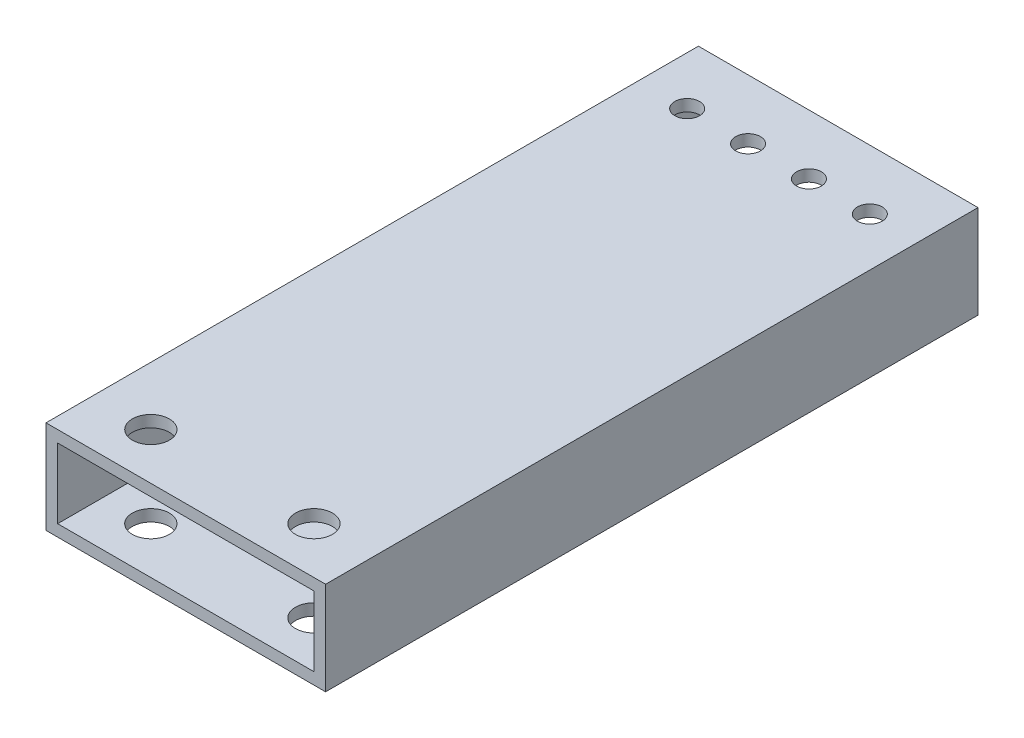
ISO-10303-21;
HEADER;
FILE_DESCRIPTION(('STEP AP214'),'2;1');
FILE_NAME('part.step','',(''),(''),'','','');
FILE_SCHEMA(('AUTOMOTIVE_DESIGN { 1 0 10303 214 1 1 1 1 }'));
ENDSEC;
DATA;
#1=APPLICATION_CONTEXT('core data for automotive mechanical design processes');
#2=APPLICATION_PROTOCOL_DEFINITION('international standard','automotive_design',2000,#1);
#3=PRODUCT_CONTEXT('',#1,'mechanical');
#4=PRODUCT('Part','Part','',(#3));
#5=PRODUCT_RELATED_PRODUCT_CATEGORY('part','',(#4));
#6=PRODUCT_DEFINITION_FORMATION('','',#4);
#7=PRODUCT_DEFINITION_CONTEXT('part definition',#1,'design');
#8=PRODUCT_DEFINITION('design','',#6,#7);
#9=PRODUCT_DEFINITION_SHAPE('','',#8);
#10=(LENGTH_UNIT() NAMED_UNIT(*) SI_UNIT(.MILLI.,.METRE.));
#11=(NAMED_UNIT(*) PLANE_ANGLE_UNIT() SI_UNIT($,.RADIAN.));
#12=(NAMED_UNIT(*) SI_UNIT($,.STERADIAN.) SOLID_ANGLE_UNIT());
#13=UNCERTAINTY_MEASURE_WITH_UNIT(LENGTH_MEASURE(1.E-05),#10,'distance_accuracy_value','');
#14=(GEOMETRIC_REPRESENTATION_CONTEXT(3) GLOBAL_UNCERTAINTY_ASSIGNED_CONTEXT((#13)) GLOBAL_UNIT_ASSIGNED_CONTEXT((#10,
#11,#12)) REPRESENTATION_CONTEXT('',''));
#15=CARTESIAN_POINT('',(0.,0.,0.));
#16=DIRECTION('',(0.,0.,1.));
#17=DIRECTION('',(1.,0.,0.));
#18=AXIS2_PLACEMENT_3D('',#15,#16,#17);
#19=CARTESIAN_POINT('',(0.,0.,177.8));
#20=DIRECTION('',(0.,0.,-1.));
#21=DIRECTION('',(-1.,0.,0.));
#22=AXIS2_PLACEMENT_3D('',#19,#20,#21);
#23=PLANE('',#22);
#24=DIRECTION('',(0.,-1.,0.));
#25=VECTOR('',#24,1.);
#26=CARTESIAN_POINT('',(0.,0.,177.8));
#27=LINE('',#26,#25);
#28=CARTESIAN_POINT('',(0.,25.4,177.8));
#29=VERTEX_POINT('',#28);
#30=CARTESIAN_POINT('',(0.,0.,177.8));
#31=VERTEX_POINT('',#30);
#32=EDGE_CURVE('E139',#29,#31,#27,.T.);
#33=ORIENTED_EDGE('',*,*,#32,.T.);
#34=DIRECTION('',(1.,0.,0.));
#35=VECTOR('',#34,1.);
#36=CARTESIAN_POINT('',(0.,0.,177.8));
#37=LINE('',#36,#35);
#38=CARTESIAN_POINT('',(76.2,0.,177.8));
#39=VERTEX_POINT('',#38);
#40=EDGE_CURVE('E142',#31,#39,#37,.T.);
#41=ORIENTED_EDGE('',*,*,#40,.T.);
#42=DIRECTION('',(0.,1.,0.));
#43=VECTOR('',#42,1.);
#44=CARTESIAN_POINT('',(76.2,0.,177.8));
#45=LINE('',#44,#43);
#46=CARTESIAN_POINT('',(76.2,25.4,177.8));
#47=VERTEX_POINT('',#46);
#48=EDGE_CURVE('E145',#39,#47,#45,.T.);
#49=ORIENTED_EDGE('',*,*,#48,.T.);
#50=DIRECTION('',(-1.,0.,0.));
#51=VECTOR('',#50,1.);
#52=CARTESIAN_POINT('',(0.,25.4,177.8));
#53=LINE('',#52,#51);
#54=EDGE_CURVE('E147',#47,#29,#53,.T.);
#55=ORIENTED_EDGE('',*,*,#54,.T.);
#56=EDGE_LOOP('',(#33,#41,#49,#55));
#57=FACE_BOUND('',#56,.T.);
#58=DIRECTION('',(0.,-1.,0.));
#59=VECTOR('',#58,1.);
#60=CARTESIAN_POINT('',(3.175,3.175,177.8));
#61=LINE('',#60,#59);
#62=CARTESIAN_POINT('',(3.175,22.225,177.8));
#63=VERTEX_POINT('',#62);
#64=CARTESIAN_POINT('',(3.175,3.175,177.8));
#65=VERTEX_POINT('',#64);
#66=EDGE_CURVE('E101',#63,#65,#61,.T.);
#67=ORIENTED_EDGE('',*,*,#66,.F.);
#68=DIRECTION('',(-1.,0.,0.));
#69=VECTOR('',#68,1.);
#70=CARTESIAN_POINT('',(3.175,22.225,177.8));
#71=LINE('',#70,#69);
#72=CARTESIAN_POINT('',(73.025,22.225,177.8));
#73=VERTEX_POINT('',#72);
#74=EDGE_CURVE('E123',#73,#63,#71,.T.);
#75=ORIENTED_EDGE('',*,*,#74,.F.);
#76=DIRECTION('',(0.,1.,0.));
#77=VECTOR('',#76,1.);
#78=CARTESIAN_POINT('',(73.025,3.175,177.8));
#79=LINE('',#78,#77);
#80=CARTESIAN_POINT('',(73.025,3.175,177.8));
#81=VERTEX_POINT('',#80);
#82=EDGE_CURVE('E121',#81,#73,#79,.T.);
#83=ORIENTED_EDGE('',*,*,#82,.F.);
#84=DIRECTION('',(1.,0.,0.));
#85=VECTOR('',#84,1.);
#86=CARTESIAN_POINT('',(3.175,3.175,177.8));
#87=LINE('',#86,#85);
#88=EDGE_CURVE('E109',#65,#81,#87,.T.);
#89=ORIENTED_EDGE('',*,*,#88,.F.);
#90=EDGE_LOOP('',(#67,#75,#83,#89));
#91=FACE_BOUND('',#90,.T.);
#92=ADVANCED_FACE('F34',(#57,#91),#23,.F.);
#93=CARTESIAN_POINT('',(0.,0.,0.));
#94=DIRECTION('',(0.,0.,-1.));
#95=DIRECTION('',(-1.,0.,0.));
#96=AXIS2_PLACEMENT_3D('',#93,#94,#95);
#97=PLANE('',#96);
#98=DIRECTION('',(0.,-1.,0.));
#99=VECTOR('',#98,1.);
#100=CARTESIAN_POINT('',(0.,0.,0.));
#101=LINE('',#100,#99);
#102=CARTESIAN_POINT('',(0.,25.4,0.));
#103=VERTEX_POINT('',#102);
#104=CARTESIAN_POINT('',(0.,0.,0.));
#105=VERTEX_POINT('',#104);
#106=EDGE_CURVE('E117',#103,#105,#101,.T.);
#107=ORIENTED_EDGE('',*,*,#106,.F.);
#108=DIRECTION('',(-1.,0.,0.));
#109=VECTOR('',#108,1.);
#110=CARTESIAN_POINT('',(0.,25.4,0.));
#111=LINE('',#110,#109);
#112=CARTESIAN_POINT('',(76.2,25.4,0.));
#113=VERTEX_POINT('',#112);
#114=EDGE_CURVE('E143',#113,#103,#111,.T.);
#115=ORIENTED_EDGE('',*,*,#114,.F.);
#116=DIRECTION('',(0.,1.,0.));
#117=VECTOR('',#116,1.);
#118=CARTESIAN_POINT('',(76.2,0.,0.));
#119=LINE('',#118,#117);
#120=CARTESIAN_POINT('',(76.2,0.,0.));
#121=VERTEX_POINT('',#120);
#122=EDGE_CURVE('E154',#121,#113,#119,.T.);
#123=ORIENTED_EDGE('',*,*,#122,.F.);
#124=DIRECTION('',(1.,0.,0.));
#125=VECTOR('',#124,1.);
#126=CARTESIAN_POINT('',(0.,0.,0.));
#127=LINE('',#126,#125);
#128=EDGE_CURVE('E152',#105,#121,#127,.T.);
#129=ORIENTED_EDGE('',*,*,#128,.F.);
#130=EDGE_LOOP('',(#107,#115,#123,#129));
#131=FACE_BOUND('',#130,.T.);
#132=DIRECTION('',(-1.,0.,0.));
#133=VECTOR('',#132,1.);
#134=CARTESIAN_POINT('',(3.175,22.225,0.));
#135=LINE('',#134,#133);
#136=CARTESIAN_POINT('',(73.025,22.225,0.));
#137=VERTEX_POINT('',#136);
#138=CARTESIAN_POINT('',(3.175,22.225,0.));
#139=VERTEX_POINT('',#138);
#140=EDGE_CURVE('E110',#137,#139,#135,.T.);
#141=ORIENTED_EDGE('',*,*,#140,.T.);
#142=DIRECTION('',(0.,-1.,0.));
#143=VECTOR('',#142,1.);
#144=CARTESIAN_POINT('',(3.175,3.175,0.));
#145=LINE('',#144,#143);
#146=CARTESIAN_POINT('',(3.175,3.175,0.));
#147=VERTEX_POINT('',#146);
#148=EDGE_CURVE('E59',#139,#147,#145,.T.);
#149=ORIENTED_EDGE('',*,*,#148,.T.);
#150=DIRECTION('',(1.,0.,0.));
#151=VECTOR('',#150,1.);
#152=CARTESIAN_POINT('',(3.175,3.175,0.));
#153=LINE('',#152,#151);
#154=CARTESIAN_POINT('',(73.025,3.175,0.));
#155=VERTEX_POINT('',#154);
#156=EDGE_CURVE('E116',#147,#155,#153,.T.);
#157=ORIENTED_EDGE('',*,*,#156,.T.);
#158=DIRECTION('',(0.,1.,0.));
#159=VECTOR('',#158,1.);
#160=CARTESIAN_POINT('',(73.025,3.175,0.));
#161=LINE('',#160,#159);
#162=EDGE_CURVE('E131',#155,#137,#161,.T.);
#163=ORIENTED_EDGE('',*,*,#162,.T.);
#164=EDGE_LOOP('',(#141,#149,#157,#163));
#165=FACE_BOUND('',#164,.T.);
#166=ADVANCED_FACE('F248',(#131,#165),#97,.T.);
#167=CARTESIAN_POINT('',(0.,0.,177.8));
#168=DIRECTION('',(1.,0.,0.));
#169=DIRECTION('',(0.,0.,-1.));
#170=AXIS2_PLACEMENT_3D('',#167,#168,#169);
#171=PLANE('',#170);
#172=ORIENTED_EDGE('',*,*,#106,.T.);
#173=DIRECTION('',(0.,0.,-1.));
#174=VECTOR('',#173,1.);
#175=CARTESIAN_POINT('',(0.,0.,177.8));
#176=LINE('',#175,#174);
#177=EDGE_CURVE('E11',#31,#105,#176,.T.);
#178=ORIENTED_EDGE('',*,*,#177,.F.);
#179=ORIENTED_EDGE('',*,*,#32,.F.);
#180=DIRECTION('',(0.,0.,-1.));
#181=VECTOR('',#180,1.);
#182=CARTESIAN_POINT('',(0.,25.4,177.8));
#183=LINE('',#182,#181);
#184=EDGE_CURVE('E149',#29,#103,#183,.T.);
#185=ORIENTED_EDGE('',*,*,#184,.T.);
#186=EDGE_LOOP('',(#172,#178,#179,#185));
#187=FACE_BOUND('',#186,.T.);
#188=ADVANCED_FACE('F36',(#187),#171,.F.);
#189=CARTESIAN_POINT('',(0.,0.,177.8));
#190=DIRECTION('',(0.,1.,0.));
#191=DIRECTION('',(0.,0.,1.));
#192=AXIS2_PLACEMENT_3D('',#189,#190,#191);
#193=PLANE('',#192);
#194=CARTESIAN_POINT('',(15.875,0.,165.1));
#195=DIRECTION('',(0.,-1.,0.));
#196=DIRECTION('',(0.,0.,-1.));
#197=AXIS2_PLACEMENT_3D('',#194,#195,#196);
#198=CIRCLE('',#197,5.04189999999999);
#199=CARTESIAN_POINT('',(15.875,0.,160.0581));
#200=VERTEX_POINT('',#199);
#201=EDGE_CURVE('E273',#200,#200,#198,.T.);
#202=ORIENTED_EDGE('',*,*,#201,.F.);
#203=EDGE_LOOP('',(#202));
#204=FACE_BOUND('',#203,.T.);
#205=CARTESIAN_POINT('',(60.325,0.,165.1));
#206=DIRECTION('',(0.,-1.,0.));
#207=DIRECTION('',(0.,0.,-1.));
#208=AXIS2_PLACEMENT_3D('',#205,#206,#207);
#209=CIRCLE('',#208,5.04189999999999);
#210=CARTESIAN_POINT('',(60.325,0.,160.0581));
#211=VERTEX_POINT('',#210);
#212=EDGE_CURVE('E190',#211,#211,#209,.T.);
#213=ORIENTED_EDGE('',*,*,#212,.F.);
#214=EDGE_LOOP('',(#213));
#215=FACE_BOUND('',#214,.T.);
#216=CARTESIAN_POINT('',(29.80436,0.,16.2687));
#217=DIRECTION('',(0.,1.,0.));
#218=DIRECTION('',(0.,0.,1.));
#219=AXIS2_PLACEMENT_3D('',#216,#217,#218);
#220=CIRCLE('',#219,3.3782);
#221=CARTESIAN_POINT('',(29.80436,0.,19.6469));
#222=VERTEX_POINT('',#221);
#223=EDGE_CURVE('E172',#222,#222,#220,.T.);
#224=ORIENTED_EDGE('',*,*,#223,.T.);
#225=EDGE_LOOP('',(#224));
#226=FACE_BOUND('',#225,.T.);
#227=CARTESIAN_POINT('',(46.39564,0.,16.2687));
#228=DIRECTION('',(0.,1.,0.));
#229=DIRECTION('',(0.,0.,1.));
#230=AXIS2_PLACEMENT_3D('',#227,#228,#229);
#231=CIRCLE('',#230,3.3782);
#232=CARTESIAN_POINT('',(46.39564,0.,19.6469));
#233=VERTEX_POINT('',#232);
#234=EDGE_CURVE('E205',#233,#233,#231,.T.);
#235=ORIENTED_EDGE('',*,*,#234,.T.);
#236=EDGE_LOOP('',(#235));
#237=FACE_BOUND('',#236,.T.);
#238=CARTESIAN_POINT('',(62.98692,0.,16.2687));
#239=DIRECTION('',(0.,1.,0.));
#240=DIRECTION('',(0.,0.,1.));
#241=AXIS2_PLACEMENT_3D('',#238,#239,#240);
#242=CIRCLE('',#241,3.37820000000001);
#243=CARTESIAN_POINT('',(62.98692,0.,19.6469));
#244=VERTEX_POINT('',#243);
#245=EDGE_CURVE('E211',#244,#244,#242,.T.);
#246=ORIENTED_EDGE('',*,*,#245,.T.);
#247=EDGE_LOOP('',(#246));
#248=FACE_BOUND('',#247,.T.);
#249=CARTESIAN_POINT('',(13.21308,0.,16.2687));
#250=DIRECTION('',(0.,1.,0.));
#251=DIRECTION('',(0.,0.,1.));
#252=AXIS2_PLACEMENT_3D('',#249,#250,#251);
#253=CIRCLE('',#252,3.3782);
#254=CARTESIAN_POINT('',(13.21308,0.,19.6469));
#255=VERTEX_POINT('',#254);
#256=EDGE_CURVE('E167',#255,#255,#253,.T.);
#257=ORIENTED_EDGE('',*,*,#256,.T.);
#258=EDGE_LOOP('',(#257));
#259=FACE_BOUND('',#258,.T.);
#260=ORIENTED_EDGE('',*,*,#128,.T.);
#261=DIRECTION('',(0.,0.,-1.));
#262=VECTOR('',#261,1.);
#263=CARTESIAN_POINT('',(76.2,0.,177.8));
#264=LINE('',#263,#262);
#265=EDGE_CURVE('E43',#39,#121,#264,.T.);
#266=ORIENTED_EDGE('',*,*,#265,.F.);
#267=ORIENTED_EDGE('',*,*,#40,.F.);
#268=ORIENTED_EDGE('',*,*,#177,.T.);
#269=EDGE_LOOP('',(#260,#266,#267,#268));
#270=FACE_BOUND('',#269,.T.);
#271=ADVANCED_FACE('F262',(#204,#215,#226,#237,#248,#259,#270),#193,.F.);
#272=CARTESIAN_POINT('',(76.2,0.,177.8));
#273=DIRECTION('',(-1.,0.,0.));
#274=DIRECTION('',(0.,0.,1.));
#275=AXIS2_PLACEMENT_3D('',#272,#273,#274);
#276=PLANE('',#275);
#277=ORIENTED_EDGE('',*,*,#122,.T.);
#278=DIRECTION('',(0.,0.,-1.));
#279=VECTOR('',#278,1.);
#280=CARTESIAN_POINT('',(76.2,25.4,177.8));
#281=LINE('',#280,#279);
#282=EDGE_CURVE('E159',#47,#113,#281,.T.);
#283=ORIENTED_EDGE('',*,*,#282,.F.);
#284=ORIENTED_EDGE('',*,*,#48,.F.);
#285=ORIENTED_EDGE('',*,*,#265,.T.);
#286=EDGE_LOOP('',(#277,#283,#284,#285));
#287=FACE_BOUND('',#286,.T.);
#288=ADVANCED_FACE('F259',(#287),#276,.F.);
#289=CARTESIAN_POINT('',(0.,25.4,177.8));
#290=DIRECTION('',(0.,-1.,0.));
#291=DIRECTION('',(0.,0.,-1.));
#292=AXIS2_PLACEMENT_3D('',#289,#290,#291);
#293=PLANE('',#292);
#294=CARTESIAN_POINT('',(15.875,25.4,165.1));
#295=DIRECTION('',(0.,-1.,0.));
#296=DIRECTION('',(0.,0.,-1.));
#297=AXIS2_PLACEMENT_3D('',#294,#295,#296);
#298=CIRCLE('',#297,5.04189999999999);
#299=CARTESIAN_POINT('',(15.875,25.4,160.0581));
#300=VERTEX_POINT('',#299);
#301=EDGE_CURVE('E342',#300,#300,#298,.T.);
#302=ORIENTED_EDGE('',*,*,#301,.T.);
#303=EDGE_LOOP('',(#302));
#304=FACE_BOUND('',#303,.T.);
#305=CARTESIAN_POINT('',(60.325,25.4,165.1));
#306=DIRECTION('',(0.,-1.,0.));
#307=DIRECTION('',(0.,0.,-1.));
#308=AXIS2_PLACEMENT_3D('',#305,#306,#307);
#309=CIRCLE('',#308,5.04189999999999);
#310=CARTESIAN_POINT('',(60.325,25.4,160.0581));
#311=VERTEX_POINT('',#310);
#312=EDGE_CURVE('E183',#311,#311,#309,.T.);
#313=ORIENTED_EDGE('',*,*,#312,.T.);
#314=EDGE_LOOP('',(#313));
#315=FACE_BOUND('',#314,.T.);
#316=CARTESIAN_POINT('',(29.80436,25.4,16.2687));
#317=DIRECTION('',(0.,1.,0.));
#318=DIRECTION('',(0.,0.,1.));
#319=AXIS2_PLACEMENT_3D('',#316,#317,#318);
#320=CIRCLE('',#319,3.3782);
#321=CARTESIAN_POINT('',(29.80436,25.4,19.6469));
#322=VERTEX_POINT('',#321);
#323=EDGE_CURVE('E202',#322,#322,#320,.T.);
#324=ORIENTED_EDGE('',*,*,#323,.F.);
#325=EDGE_LOOP('',(#324));
#326=FACE_BOUND('',#325,.T.);
#327=CARTESIAN_POINT('',(46.39564,25.4,16.2687));
#328=DIRECTION('',(0.,1.,0.));
#329=DIRECTION('',(0.,0.,1.));
#330=AXIS2_PLACEMENT_3D('',#327,#328,#329);
#331=CIRCLE('',#330,3.3782);
#332=CARTESIAN_POINT('',(46.39564,25.4,19.6469));
#333=VERTEX_POINT('',#332);
#334=EDGE_CURVE('E208',#333,#333,#331,.T.);
#335=ORIENTED_EDGE('',*,*,#334,.F.);
#336=EDGE_LOOP('',(#335));
#337=FACE_BOUND('',#336,.T.);
#338=CARTESIAN_POINT('',(62.98692,25.4,16.2687));
#339=DIRECTION('',(0.,1.,0.));
#340=DIRECTION('',(0.,0.,1.));
#341=AXIS2_PLACEMENT_3D('',#338,#339,#340);
#342=CIRCLE('',#341,3.37820000000001);
#343=CARTESIAN_POINT('',(62.98692,25.4,19.6469));
#344=VERTEX_POINT('',#343);
#345=EDGE_CURVE('E187',#344,#344,#342,.T.);
#346=ORIENTED_EDGE('',*,*,#345,.F.);
#347=EDGE_LOOP('',(#346));
#348=FACE_BOUND('',#347,.T.);
#349=CARTESIAN_POINT('',(13.21308,25.4,16.2687));
#350=DIRECTION('',(0.,1.,0.));
#351=DIRECTION('',(0.,0.,1.));
#352=AXIS2_PLACEMENT_3D('',#349,#350,#351);
#353=CIRCLE('',#352,3.3782);
#354=CARTESIAN_POINT('',(13.21308,25.4,19.6469));
#355=VERTEX_POINT('',#354);
#356=EDGE_CURVE('E222',#355,#355,#353,.T.);
#357=ORIENTED_EDGE('',*,*,#356,.F.);
#358=EDGE_LOOP('',(#357));
#359=FACE_BOUND('',#358,.T.);
#360=ORIENTED_EDGE('',*,*,#114,.T.);
#361=ORIENTED_EDGE('',*,*,#184,.F.);
#362=ORIENTED_EDGE('',*,*,#54,.F.);
#363=ORIENTED_EDGE('',*,*,#282,.T.);
#364=EDGE_LOOP('',(#360,#361,#362,#363));
#365=FACE_BOUND('',#364,.T.);
#366=ADVANCED_FACE('F243',(#304,#315,#326,#337,#348,#359,#365),#293,.F.);
#367=CARTESIAN_POINT('',(3.175,3.175,177.8));
#368=DIRECTION('',(1.,0.,0.));
#369=DIRECTION('',(0.,0.,-1.));
#370=AXIS2_PLACEMENT_3D('',#367,#368,#369);
#371=PLANE('',#370);
#372=ORIENTED_EDGE('',*,*,#148,.F.);
#373=DIRECTION('',(0.,0.,-1.));
#374=VECTOR('',#373,1.);
#375=CARTESIAN_POINT('',(3.175,22.225,177.8));
#376=LINE('',#375,#374);
#377=EDGE_CURVE('E105',#63,#139,#376,.T.);
#378=ORIENTED_EDGE('',*,*,#377,.F.);
#379=ORIENTED_EDGE('',*,*,#66,.T.);
#380=DIRECTION('',(0.,0.,-1.));
#381=VECTOR('',#380,1.);
#382=CARTESIAN_POINT('',(3.175,3.175,177.8));
#383=LINE('',#382,#381);
#384=EDGE_CURVE('E104',#65,#147,#383,.T.);
#385=ORIENTED_EDGE('',*,*,#384,.T.);
#386=EDGE_LOOP('',(#372,#378,#379,#385));
#387=FACE_BOUND('',#386,.T.);
#388=ADVANCED_FACE('F103',(#387),#371,.T.);
#389=CARTESIAN_POINT('',(3.175,3.175,177.8));
#390=DIRECTION('',(0.,1.,0.));
#391=DIRECTION('',(0.,0.,1.));
#392=AXIS2_PLACEMENT_3D('',#389,#390,#391);
#393=PLANE('',#392);
#394=CARTESIAN_POINT('',(15.875,3.175,165.1));
#395=DIRECTION('',(0.,1.,0.));
#396=DIRECTION('',(0.,0.,1.));
#397=AXIS2_PLACEMENT_3D('',#394,#395,#396);
#398=CIRCLE('',#397,5.04189999999999);
#399=CARTESIAN_POINT('',(15.875,3.175,170.1419));
#400=VERTEX_POINT('',#399);
#401=EDGE_CURVE('E195',#400,#400,#398,.T.);
#402=ORIENTED_EDGE('',*,*,#401,.F.);
#403=EDGE_LOOP('',(#402));
#404=FACE_BOUND('',#403,.T.);
#405=CARTESIAN_POINT('',(60.325,3.175,165.1));
#406=DIRECTION('',(0.,1.,0.));
#407=DIRECTION('',(0.,0.,1.));
#408=AXIS2_PLACEMENT_3D('',#405,#406,#407);
#409=CIRCLE('',#408,5.04189999999999);
#410=CARTESIAN_POINT('',(60.325,3.175,170.1419));
#411=VERTEX_POINT('',#410);
#412=EDGE_CURVE('E182',#411,#411,#409,.T.);
#413=ORIENTED_EDGE('',*,*,#412,.F.);
#414=EDGE_LOOP('',(#413));
#415=FACE_BOUND('',#414,.T.);
#416=CARTESIAN_POINT('',(29.80436,3.175,16.2687));
#417=DIRECTION('',(0.,1.,0.));
#418=DIRECTION('',(0.,0.,1.));
#419=AXIS2_PLACEMENT_3D('',#416,#417,#418);
#420=CIRCLE('',#419,3.3782);
#421=CARTESIAN_POINT('',(29.80436,3.175,19.6469));
#422=VERTEX_POINT('',#421);
#423=EDGE_CURVE('E179',#422,#422,#420,.T.);
#424=ORIENTED_EDGE('',*,*,#423,.F.);
#425=EDGE_LOOP('',(#424));
#426=FACE_BOUND('',#425,.T.);
#427=CARTESIAN_POINT('',(46.39564,3.175,16.2687));
#428=DIRECTION('',(0.,1.,0.));
#429=DIRECTION('',(0.,0.,1.));
#430=AXIS2_PLACEMENT_3D('',#427,#428,#429);
#431=CIRCLE('',#430,3.3782);
#432=CARTESIAN_POINT('',(46.39564,3.175,19.6469));
#433=VERTEX_POINT('',#432);
#434=EDGE_CURVE('E176',#433,#433,#431,.T.);
#435=ORIENTED_EDGE('',*,*,#434,.F.);
#436=EDGE_LOOP('',(#435));
#437=FACE_BOUND('',#436,.T.);
#438=CARTESIAN_POINT('',(62.98692,3.175,16.2687));
#439=DIRECTION('',(0.,1.,0.));
#440=DIRECTION('',(0.,0.,1.));
#441=AXIS2_PLACEMENT_3D('',#438,#439,#440);
#442=CIRCLE('',#441,3.37820000000001);
#443=CARTESIAN_POINT('',(62.98692,3.175,19.6469));
#444=VERTEX_POINT('',#443);
#445=EDGE_CURVE('E171',#444,#444,#442,.T.);
#446=ORIENTED_EDGE('',*,*,#445,.F.);
#447=EDGE_LOOP('',(#446));
#448=FACE_BOUND('',#447,.T.);
#449=CARTESIAN_POINT('',(13.21308,3.175,16.2687));
#450=DIRECTION('',(0.,1.,0.));
#451=DIRECTION('',(0.,0.,1.));
#452=AXIS2_PLACEMENT_3D('',#449,#450,#451);
#453=CIRCLE('',#452,3.3782);
#454=CARTESIAN_POINT('',(13.21308,3.175,19.6469));
#455=VERTEX_POINT('',#454);
#456=EDGE_CURVE('E129',#455,#455,#453,.T.);
#457=ORIENTED_EDGE('',*,*,#456,.F.);
#458=EDGE_LOOP('',(#457));
#459=FACE_BOUND('',#458,.T.);
#460=ORIENTED_EDGE('',*,*,#156,.F.);
#461=ORIENTED_EDGE('',*,*,#384,.F.);
#462=ORIENTED_EDGE('',*,*,#88,.T.);
#463=DIRECTION('',(0.,0.,-1.));
#464=VECTOR('',#463,1.);
#465=CARTESIAN_POINT('',(73.025,3.175,177.8));
#466=LINE('',#465,#464);
#467=EDGE_CURVE('E118',#81,#155,#466,.T.);
#468=ORIENTED_EDGE('',*,*,#467,.T.);
#469=EDGE_LOOP('',(#460,#461,#462,#468));
#470=FACE_BOUND('',#469,.T.);
#471=ADVANCED_FACE('F113',(#404,#415,#426,#437,#448,#459,#470),#393,.T.);
#472=CARTESIAN_POINT('',(73.025,3.175,177.8));
#473=DIRECTION('',(-1.,0.,0.));
#474=DIRECTION('',(0.,0.,1.));
#475=AXIS2_PLACEMENT_3D('',#472,#473,#474);
#476=PLANE('',#475);
#477=ORIENTED_EDGE('',*,*,#162,.F.);
#478=ORIENTED_EDGE('',*,*,#467,.F.);
#479=ORIENTED_EDGE('',*,*,#82,.T.);
#480=DIRECTION('',(0.,0.,-1.));
#481=VECTOR('',#480,1.);
#482=CARTESIAN_POINT('',(73.025,22.225,177.8));
#483=LINE('',#482,#481);
#484=EDGE_CURVE('E51',#73,#137,#483,.T.);
#485=ORIENTED_EDGE('',*,*,#484,.T.);
#486=EDGE_LOOP('',(#477,#478,#479,#485));
#487=FACE_BOUND('',#486,.T.);
#488=ADVANCED_FACE('F233',(#487),#476,.T.);
#489=CARTESIAN_POINT('',(3.175,22.225,177.8));
#490=DIRECTION('',(0.,-1.,0.));
#491=DIRECTION('',(0.,0.,-1.));
#492=AXIS2_PLACEMENT_3D('',#489,#490,#491);
#493=PLANE('',#492);
#494=CARTESIAN_POINT('',(15.875,22.225,165.1));
#495=DIRECTION('',(0.,-1.,0.));
#496=DIRECTION('',(0.,0.,-1.));
#497=AXIS2_PLACEMENT_3D('',#494,#495,#496);
#498=CIRCLE('',#497,5.04189999999999);
#499=CARTESIAN_POINT('',(15.875,22.225,160.0581));
#500=VERTEX_POINT('',#499);
#501=EDGE_CURVE('E38',#500,#500,#498,.T.);
#502=ORIENTED_EDGE('',*,*,#501,.F.);
#503=EDGE_LOOP('',(#502));
#504=FACE_BOUND('',#503,.T.);
#505=CARTESIAN_POINT('',(60.325,22.225,165.1));
#506=DIRECTION('',(0.,-1.,0.));
#507=DIRECTION('',(0.,0.,-1.));
#508=AXIS2_PLACEMENT_3D('',#505,#506,#507);
#509=CIRCLE('',#508,5.04189999999999);
#510=CARTESIAN_POINT('',(60.325,22.225,160.0581));
#511=VERTEX_POINT('',#510);
#512=EDGE_CURVE('E180',#511,#511,#509,.T.);
#513=ORIENTED_EDGE('',*,*,#512,.F.);
#514=EDGE_LOOP('',(#513));
#515=FACE_BOUND('',#514,.T.);
#516=CARTESIAN_POINT('',(29.80436,22.225,16.2687));
#517=DIRECTION('',(0.,-1.,0.));
#518=DIRECTION('',(0.,0.,-1.));
#519=AXIS2_PLACEMENT_3D('',#516,#517,#518);
#520=CIRCLE('',#519,3.3782);
#521=CARTESIAN_POINT('',(29.80436,22.225,12.8905));
#522=VERTEX_POINT('',#521);
#523=EDGE_CURVE('E177',#522,#522,#520,.T.);
#524=ORIENTED_EDGE('',*,*,#523,.F.);
#525=EDGE_LOOP('',(#524));
#526=FACE_BOUND('',#525,.T.);
#527=CARTESIAN_POINT('',(46.39564,22.225,16.2687));
#528=DIRECTION('',(0.,-1.,0.));
#529=DIRECTION('',(0.,0.,-1.));
#530=AXIS2_PLACEMENT_3D('',#527,#528,#529);
#531=CIRCLE('',#530,3.3782);
#532=CARTESIAN_POINT('',(46.39564,22.225,12.8905));
#533=VERTEX_POINT('',#532);
#534=EDGE_CURVE('E173',#533,#533,#531,.T.);
#535=ORIENTED_EDGE('',*,*,#534,.F.);
#536=EDGE_LOOP('',(#535));
#537=FACE_BOUND('',#536,.T.);
#538=CARTESIAN_POINT('',(62.98692,22.225,16.2687));
#539=DIRECTION('',(0.,-1.,0.));
#540=DIRECTION('',(0.,0.,-1.));
#541=AXIS2_PLACEMENT_3D('',#538,#539,#540);
#542=CIRCLE('',#541,3.37820000000001);
#543=CARTESIAN_POINT('',(62.98692,22.225,12.8905));
#544=VERTEX_POINT('',#543);
#545=EDGE_CURVE('E168',#544,#544,#542,.T.);
#546=ORIENTED_EDGE('',*,*,#545,.F.);
#547=EDGE_LOOP('',(#546));
#548=FACE_BOUND('',#547,.T.);
#549=CARTESIAN_POINT('',(13.21308,22.225,16.2687));
#550=DIRECTION('',(0.,-1.,0.));
#551=DIRECTION('',(0.,0.,-1.));
#552=AXIS2_PLACEMENT_3D('',#549,#550,#551);
#553=CIRCLE('',#552,3.3782);
#554=CARTESIAN_POINT('',(13.21308,22.225,12.8905));
#555=VERTEX_POINT('',#554);
#556=EDGE_CURVE('E164',#555,#555,#553,.T.);
#557=ORIENTED_EDGE('',*,*,#556,.F.);
#558=EDGE_LOOP('',(#557));
#559=FACE_BOUND('',#558,.T.);
#560=ORIENTED_EDGE('',*,*,#140,.F.);
#561=ORIENTED_EDGE('',*,*,#484,.F.);
#562=ORIENTED_EDGE('',*,*,#74,.T.);
#563=ORIENTED_EDGE('',*,*,#377,.T.);
#564=EDGE_LOOP('',(#560,#561,#562,#563));
#565=FACE_BOUND('',#564,.T.);
#566=ADVANCED_FACE('F240',(#504,#515,#526,#537,#548,#559,#565),#493,.T.);
#567=CARTESIAN_POINT('',(13.21308,0.,16.2687));
#568=DIRECTION('',(0.,1.,0.));
#569=DIRECTION('',(0.,0.,1.));
#570=AXIS2_PLACEMENT_3D('',#567,#568,#569);
#571=CYLINDRICAL_SURFACE('',#570,3.3782);
#572=ORIENTED_EDGE('',*,*,#556,.T.);
#573=EDGE_LOOP('',(#572));
#574=FACE_BOUND('',#573,.T.);
#575=ORIENTED_EDGE('',*,*,#356,.T.);
#576=EDGE_LOOP('',(#575));
#577=FACE_BOUND('',#576,.T.);
#578=ADVANCED_FACE('F298',(#574,#577),#571,.F.);
#579=ORIENTED_EDGE('',*,*,#456,.T.);
#580=EDGE_LOOP('',(#579));
#581=FACE_BOUND('',#580,.T.);
#582=ORIENTED_EDGE('',*,*,#256,.F.);
#583=EDGE_LOOP('',(#582));
#584=FACE_BOUND('',#583,.T.);
#585=ADVANCED_FACE('F229',(#581,#584),#571,.F.);
#586=CARTESIAN_POINT('',(62.98692,0.,16.2687));
#587=DIRECTION('',(0.,1.,0.));
#588=DIRECTION('',(0.,0.,1.));
#589=AXIS2_PLACEMENT_3D('',#586,#587,#588);
#590=CYLINDRICAL_SURFACE('',#589,3.37820000000001);
#591=ORIENTED_EDGE('',*,*,#545,.T.);
#592=EDGE_LOOP('',(#591));
#593=FACE_BOUND('',#592,.T.);
#594=ORIENTED_EDGE('',*,*,#345,.T.);
#595=EDGE_LOOP('',(#594));
#596=FACE_BOUND('',#595,.T.);
#597=ADVANCED_FACE('F309',(#593,#596),#590,.F.);
#598=CARTESIAN_POINT('',(46.39564,0.,16.2687));
#599=DIRECTION('',(0.,1.,0.));
#600=DIRECTION('',(0.,0.,1.));
#601=AXIS2_PLACEMENT_3D('',#598,#599,#600);
#602=CYLINDRICAL_SURFACE('',#601,3.3782);
#603=ORIENTED_EDGE('',*,*,#534,.T.);
#604=EDGE_LOOP('',(#603));
#605=FACE_BOUND('',#604,.T.);
#606=ORIENTED_EDGE('',*,*,#334,.T.);
#607=EDGE_LOOP('',(#606));
#608=FACE_BOUND('',#607,.T.);
#609=ADVANCED_FACE('F312',(#605,#608),#602,.F.);
#610=CARTESIAN_POINT('',(29.80436,0.,16.2687));
#611=DIRECTION('',(0.,1.,0.));
#612=DIRECTION('',(0.,0.,1.));
#613=AXIS2_PLACEMENT_3D('',#610,#611,#612);
#614=CYLINDRICAL_SURFACE('',#613,3.3782);
#615=ORIENTED_EDGE('',*,*,#523,.T.);
#616=EDGE_LOOP('',(#615));
#617=FACE_BOUND('',#616,.T.);
#618=ORIENTED_EDGE('',*,*,#323,.T.);
#619=EDGE_LOOP('',(#618));
#620=FACE_BOUND('',#619,.T.);
#621=ADVANCED_FACE('F317',(#617,#620),#614,.F.);
#622=ORIENTED_EDGE('',*,*,#445,.T.);
#623=EDGE_LOOP('',(#622));
#624=FACE_BOUND('',#623,.T.);
#625=ORIENTED_EDGE('',*,*,#245,.F.);
#626=EDGE_LOOP('',(#625));
#627=FACE_BOUND('',#626,.T.);
#628=ADVANCED_FACE('F314',(#624,#627),#590,.F.);
#629=ORIENTED_EDGE('',*,*,#434,.T.);
#630=EDGE_LOOP('',(#629));
#631=FACE_BOUND('',#630,.T.);
#632=ORIENTED_EDGE('',*,*,#234,.F.);
#633=EDGE_LOOP('',(#632));
#634=FACE_BOUND('',#633,.T.);
#635=ADVANCED_FACE('F319',(#631,#634),#602,.F.);
#636=ORIENTED_EDGE('',*,*,#423,.T.);
#637=EDGE_LOOP('',(#636));
#638=FACE_BOUND('',#637,.T.);
#639=ORIENTED_EDGE('',*,*,#223,.F.);
#640=EDGE_LOOP('',(#639));
#641=FACE_BOUND('',#640,.T.);
#642=ADVANCED_FACE('F323',(#638,#641),#614,.F.);
#643=CARTESIAN_POINT('',(60.325,25.4,165.1));
#644=DIRECTION('',(0.,-1.,0.));
#645=DIRECTION('',(0.,0.,-1.));
#646=AXIS2_PLACEMENT_3D('',#643,#644,#645);
#647=CYLINDRICAL_SURFACE('',#646,5.04189999999999);
#648=ORIENTED_EDGE('',*,*,#512,.T.);
#649=EDGE_LOOP('',(#648));
#650=FACE_BOUND('',#649,.T.);
#651=ORIENTED_EDGE('',*,*,#312,.F.);
#652=EDGE_LOOP('',(#651));
#653=FACE_BOUND('',#652,.T.);
#654=ADVANCED_FACE('F324',(#650,#653),#647,.F.);
#655=ORIENTED_EDGE('',*,*,#412,.T.);
#656=EDGE_LOOP('',(#655));
#657=FACE_BOUND('',#656,.T.);
#658=ORIENTED_EDGE('',*,*,#212,.T.);
#659=EDGE_LOOP('',(#658));
#660=FACE_BOUND('',#659,.T.);
#661=ADVANCED_FACE('F327',(#657,#660),#647,.F.);
#662=CARTESIAN_POINT('',(15.875,25.4,165.1));
#663=DIRECTION('',(0.,-1.,0.));
#664=DIRECTION('',(0.,0.,-1.));
#665=AXIS2_PLACEMENT_3D('',#662,#663,#664);
#666=CYLINDRICAL_SURFACE('',#665,5.04189999999999);
#667=ORIENTED_EDGE('',*,*,#501,.T.);
#668=EDGE_LOOP('',(#667));
#669=FACE_BOUND('',#668,.T.);
#670=ORIENTED_EDGE('',*,*,#301,.F.);
#671=EDGE_LOOP('',(#670));
#672=FACE_BOUND('',#671,.T.);
#673=ADVANCED_FACE('F328',(#669,#672),#666,.F.);
#674=ORIENTED_EDGE('',*,*,#401,.T.);
#675=EDGE_LOOP('',(#674));
#676=FACE_BOUND('',#675,.T.);
#677=ORIENTED_EDGE('',*,*,#201,.T.);
#678=EDGE_LOOP('',(#677));
#679=FACE_BOUND('',#678,.T.);
#680=ADVANCED_FACE('F330',(#676,#679),#666,.F.);
#681=CLOSED_SHELL('',(#92,#166,#188,#271,#288,#366,#388,#471,#488,#566,#578,#585,#597,#609,#621,
#628,#635,#642,#654,#661,#673,#680));
#682=MANIFOLD_SOLID_BREP('B2',#681);
#683=ADVANCED_BREP_SHAPE_REPRESENTATION('',(#18,#682),#14);
#684=SHAPE_DEFINITION_REPRESENTATION(#9,#683);
ENDSEC;
END-ISO-10303-21;
